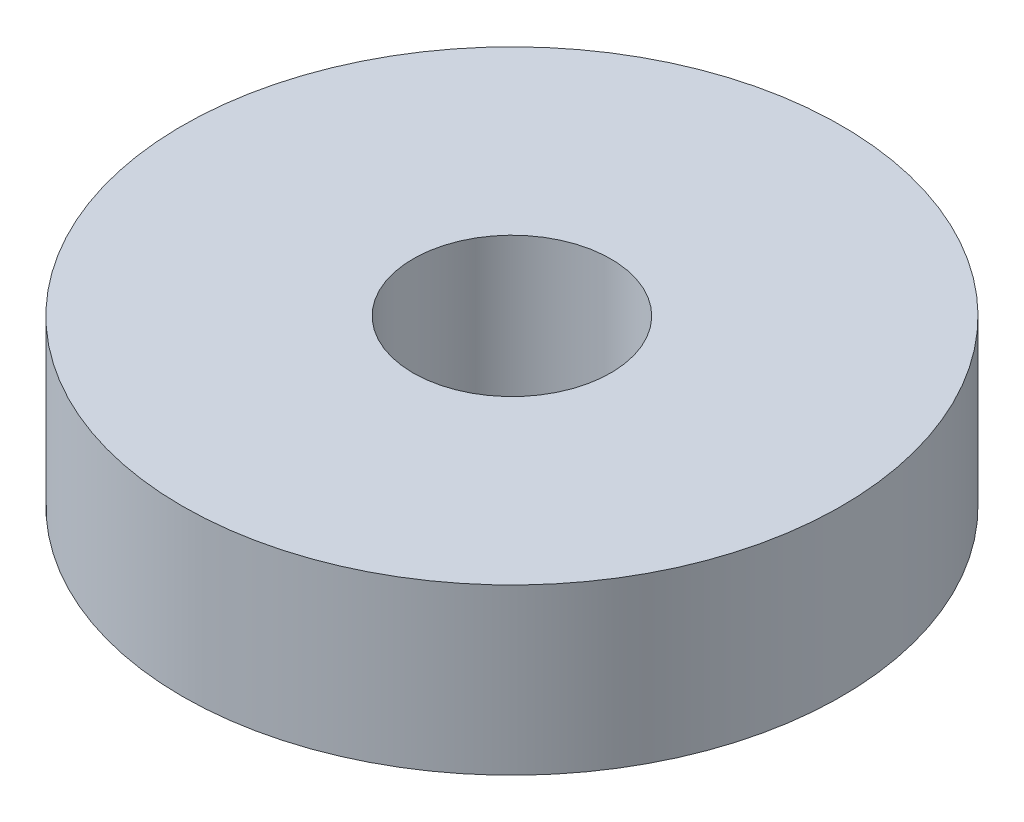
ISO-10303-21;
HEADER;
FILE_DESCRIPTION(('STEP AP214'),'2;1');
FILE_NAME('part.step','',(''),(''),'','','');
FILE_SCHEMA(('AUTOMOTIVE_DESIGN { 1 0 10303 214 1 1 1 1 }'));
ENDSEC;
DATA;
#1=APPLICATION_CONTEXT('core data for automotive mechanical design processes');
#2=APPLICATION_PROTOCOL_DEFINITION('international standard','automotive_design',2000,#1);
#3=PRODUCT_CONTEXT('',#1,'mechanical');
#4=PRODUCT('Part','Part','',(#3));
#5=PRODUCT_RELATED_PRODUCT_CATEGORY('part','',(#4));
#6=PRODUCT_DEFINITION_FORMATION('','',#4);
#7=PRODUCT_DEFINITION_CONTEXT('part definition',#1,'design');
#8=PRODUCT_DEFINITION('design','',#6,#7);
#9=PRODUCT_DEFINITION_SHAPE('','',#8);
#10=(LENGTH_UNIT() NAMED_UNIT(*) SI_UNIT(.MILLI.,.METRE.));
#11=(NAMED_UNIT(*) PLANE_ANGLE_UNIT() SI_UNIT($,.RADIAN.));
#12=(NAMED_UNIT(*) SI_UNIT($,.STERADIAN.) SOLID_ANGLE_UNIT());
#13=UNCERTAINTY_MEASURE_WITH_UNIT(LENGTH_MEASURE(1.E-05),#10,'distance_accuracy_value','');
#14=(GEOMETRIC_REPRESENTATION_CONTEXT(3) GLOBAL_UNCERTAINTY_ASSIGNED_CONTEXT((#13)) GLOBAL_UNIT_ASSIGNED_CONTEXT((#10,
#11,#12)) REPRESENTATION_CONTEXT('',''));
#15=CARTESIAN_POINT('',(0.,0.,0.));
#16=DIRECTION('',(0.,0.,1.));
#17=DIRECTION('',(1.,0.,0.));
#18=AXIS2_PLACEMENT_3D('',#15,#16,#17);
#19=CARTESIAN_POINT('',(0.,3.175,0.));
#20=DIRECTION('',(0.,1.,0.));
#21=DIRECTION('',(0.,0.,1.));
#22=AXIS2_PLACEMENT_3D('',#19,#20,#21);
#23=PLANE('',#22);
#24=CARTESIAN_POINT('',(0.,3.175,0.));
#25=DIRECTION('',(0.,1.,0.));
#26=DIRECTION('',(0.,0.,1.));
#27=AXIS2_PLACEMENT_3D('',#24,#25,#26);
#28=CIRCLE('',#27,6.35);
#29=CARTESIAN_POINT('',(0.,3.175,6.35));
#30=VERTEX_POINT('',#29);
#31=EDGE_CURVE('E10',#30,#30,#28,.T.);
#32=ORIENTED_EDGE('',*,*,#31,.T.);
#33=EDGE_LOOP('',(#32));
#34=FACE_BOUND('',#33,.T.);
#35=CARTESIAN_POINT('',(0.,3.175,0.));
#36=DIRECTION('',(0.,1.,0.));
#37=DIRECTION('',(0.,0.,1.));
#38=AXIS2_PLACEMENT_3D('',#35,#36,#37);
#39=CIRCLE('',#38,1.905);
#40=CARTESIAN_POINT('',(0.,3.175,1.905));
#41=VERTEX_POINT('',#40);
#42=EDGE_CURVE('E42',#41,#41,#39,.T.);
#43=ORIENTED_EDGE('',*,*,#42,.F.);
#44=EDGE_LOOP('',(#43));
#45=FACE_BOUND('',#44,.T.);
#46=ADVANCED_FACE('F31',(#34,#45),#23,.T.);
#47=CARTESIAN_POINT('',(0.,0.,0.));
#48=DIRECTION('',(0.,1.,0.));
#49=DIRECTION('',(0.,0.,1.));
#50=AXIS2_PLACEMENT_3D('',#47,#48,#49);
#51=PLANE('',#50);
#52=CARTESIAN_POINT('',(0.,0.,0.));
#53=DIRECTION('',(0.,1.,0.));
#54=DIRECTION('',(0.,0.,1.));
#55=AXIS2_PLACEMENT_3D('',#52,#53,#54);
#56=CIRCLE('',#55,6.35);
#57=CARTESIAN_POINT('',(0.,0.,6.35));
#58=VERTEX_POINT('',#57);
#59=EDGE_CURVE('E35',#58,#58,#56,.T.);
#60=ORIENTED_EDGE('',*,*,#59,.F.);
#61=EDGE_LOOP('',(#60));
#62=FACE_BOUND('',#61,.T.);
#63=CARTESIAN_POINT('',(0.,0.,0.));
#64=DIRECTION('',(0.,1.,0.));
#65=DIRECTION('',(0.,0.,1.));
#66=AXIS2_PLACEMENT_3D('',#63,#64,#65);
#67=CIRCLE('',#66,1.905);
#68=CARTESIAN_POINT('',(0.,0.,1.905));
#69=VERTEX_POINT('',#68);
#70=EDGE_CURVE('E44',#69,#69,#67,.T.);
#71=ORIENTED_EDGE('',*,*,#70,.T.);
#72=EDGE_LOOP('',(#71));
#73=FACE_BOUND('',#72,.T.);
#74=ADVANCED_FACE('F54',(#62,#73),#51,.F.);
#75=CARTESIAN_POINT('',(0.,3.175,0.));
#76=DIRECTION('',(0.,-1.,0.));
#77=DIRECTION('',(0.,0.,-1.));
#78=AXIS2_PLACEMENT_3D('',#75,#76,#77);
#79=CYLINDRICAL_SURFACE('',#78,6.35);
#80=ORIENTED_EDGE('',*,*,#31,.F.);
#81=EDGE_LOOP('',(#80));
#82=FACE_BOUND('',#81,.T.);
#83=ORIENTED_EDGE('',*,*,#59,.T.);
#84=EDGE_LOOP('',(#83));
#85=FACE_BOUND('',#84,.T.);
#86=ADVANCED_FACE('F33',(#82,#85),#79,.T.);
#87=CARTESIAN_POINT('',(0.,3.175,0.));
#88=DIRECTION('',(0.,-1.,0.));
#89=DIRECTION('',(0.,0.,-1.));
#90=AXIS2_PLACEMENT_3D('',#87,#88,#89);
#91=CYLINDRICAL_SURFACE('',#90,1.905);
#92=ORIENTED_EDGE('',*,*,#42,.T.);
#93=EDGE_LOOP('',(#92));
#94=FACE_BOUND('',#93,.T.);
#95=ORIENTED_EDGE('',*,*,#70,.F.);
#96=EDGE_LOOP('',(#95));
#97=FACE_BOUND('',#96,.T.);
#98=ADVANCED_FACE('F50',(#94,#97),#91,.F.);
#99=CLOSED_SHELL('',(#46,#74,#86,#98));
#100=MANIFOLD_SOLID_BREP('B2',#99);
#101=ADVANCED_BREP_SHAPE_REPRESENTATION('',(#18,#100),#14);
#102=SHAPE_DEFINITION_REPRESENTATION(#9,#101);
ENDSEC;
END-ISO-10303-21;
